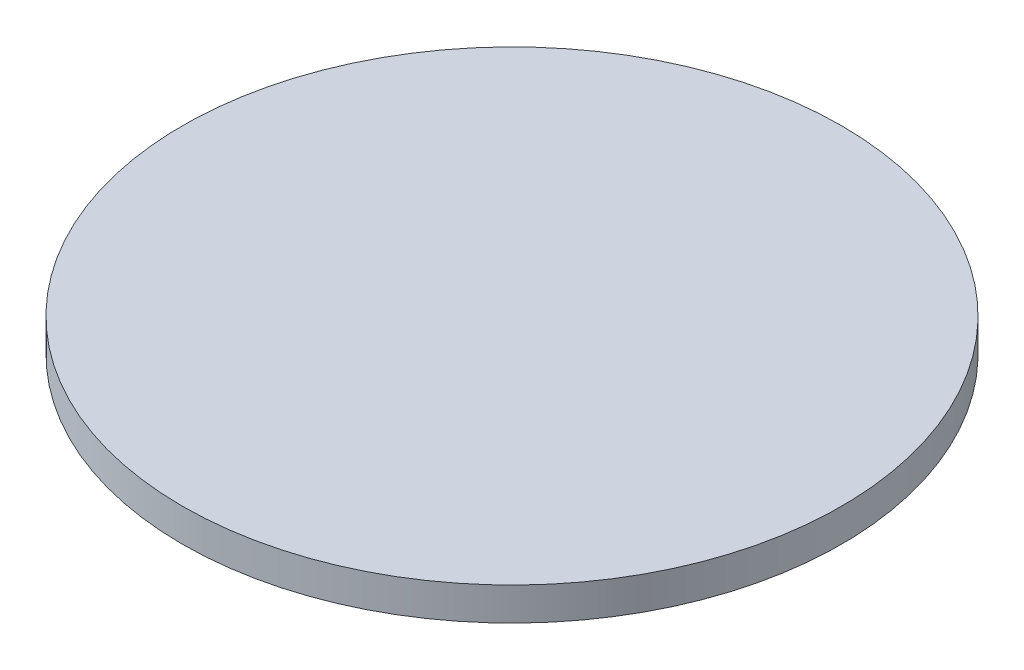
ISO-10303-21;
HEADER;
FILE_DESCRIPTION(('STEP AP214'),'2;1');
FILE_NAME('part.step','',(''),(''),'','','');
FILE_SCHEMA(('AUTOMOTIVE_DESIGN { 1 0 10303 214 1 1 1 1 }'));
ENDSEC;
DATA;
#1=APPLICATION_CONTEXT('core data for automotive mechanical design processes');
#2=APPLICATION_PROTOCOL_DEFINITION('international standard','automotive_design',2000,#1);
#3=PRODUCT_CONTEXT('',#1,'mechanical');
#4=PRODUCT('Part','Part','',(#3));
#5=PRODUCT_RELATED_PRODUCT_CATEGORY('part','',(#4));
#6=PRODUCT_DEFINITION_FORMATION('','',#4);
#7=PRODUCT_DEFINITION_CONTEXT('part definition',#1,'design');
#8=PRODUCT_DEFINITION('design','',#6,#7);
#9=PRODUCT_DEFINITION_SHAPE('','',#8);
#10=(LENGTH_UNIT() NAMED_UNIT(*) SI_UNIT(.MILLI.,.METRE.));
#11=(NAMED_UNIT(*) PLANE_ANGLE_UNIT() SI_UNIT($,.RADIAN.));
#12=(NAMED_UNIT(*) SI_UNIT($,.STERADIAN.) SOLID_ANGLE_UNIT());
#13=UNCERTAINTY_MEASURE_WITH_UNIT(LENGTH_MEASURE(1.E-05),#10,'distance_accuracy_value','');
#14=(GEOMETRIC_REPRESENTATION_CONTEXT(3) GLOBAL_UNCERTAINTY_ASSIGNED_CONTEXT((#13)) GLOBAL_UNIT_ASSIGNED_CONTEXT((#10,
#11,#12)) REPRESENTATION_CONTEXT('',''));
#15=CARTESIAN_POINT('',(0.,0.,0.));
#16=DIRECTION('',(0.,0.,1.));
#17=DIRECTION('',(1.,0.,0.));
#18=AXIS2_PLACEMENT_3D('',#15,#16,#17);
#19=CARTESIAN_POINT('',(0.,5.,0.));
#20=DIRECTION('',(0.,-1.,0.));
#21=DIRECTION('',(0.,0.,-1.));
#22=AXIS2_PLACEMENT_3D('',#19,#20,#21);
#23=CYLINDRICAL_SURFACE('',#22,50.);
#24=CARTESIAN_POINT('',(0.,5.,0.));
#25=DIRECTION('',(0.,1.,0.));
#26=DIRECTION('',(0.,0.,1.));
#27=AXIS2_PLACEMENT_3D('',#24,#25,#26);
#28=CIRCLE('',#27,50.);
#29=CARTESIAN_POINT('',(0.,5.,50.));
#30=VERTEX_POINT('',#29);
#31=EDGE_CURVE('E10',#30,#30,#28,.T.);
#32=ORIENTED_EDGE('',*,*,#31,.F.);
#33=EDGE_LOOP('',(#32));
#34=FACE_BOUND('',#33,.T.);
#35=CARTESIAN_POINT('',(0.,0.,0.));
#36=DIRECTION('',(0.,1.,0.));
#37=DIRECTION('',(0.,0.,1.));
#38=AXIS2_PLACEMENT_3D('',#35,#36,#37);
#39=CIRCLE('',#38,50.);
#40=CARTESIAN_POINT('',(0.,0.,50.));
#41=VERTEX_POINT('',#40);
#42=EDGE_CURVE('E34',#41,#41,#39,.T.);
#43=ORIENTED_EDGE('',*,*,#42,.T.);
#44=EDGE_LOOP('',(#43));
#45=FACE_BOUND('',#44,.T.);
#46=ADVANCED_FACE('F31',(#34,#45),#23,.T.);
#47=CARTESIAN_POINT('',(0.,5.,0.));
#48=DIRECTION('',(0.,1.,0.));
#49=DIRECTION('',(0.,0.,1.));
#50=AXIS2_PLACEMENT_3D('',#47,#48,#49);
#51=PLANE('',#50);
#52=ORIENTED_EDGE('',*,*,#31,.T.);
#53=EDGE_LOOP('',(#52));
#54=FACE_BOUND('',#53,.T.);
#55=ADVANCED_FACE('F46',(#54),#51,.T.);
#56=CARTESIAN_POINT('',(0.,0.,0.));
#57=DIRECTION('',(0.,1.,0.));
#58=DIRECTION('',(0.,0.,1.));
#59=AXIS2_PLACEMENT_3D('',#56,#57,#58);
#60=PLANE('',#59);
#61=ORIENTED_EDGE('',*,*,#42,.F.);
#62=EDGE_LOOP('',(#61));
#63=FACE_BOUND('',#62,.T.);
#64=ADVANCED_FACE('F44',(#63),#60,.F.);
#65=CLOSED_SHELL('',(#46,#55,#64));
#66=MANIFOLD_SOLID_BREP('B2',#65);
#67=ADVANCED_BREP_SHAPE_REPRESENTATION('',(#18,#66),#14);
#68=SHAPE_DEFINITION_REPRESENTATION(#9,#67);
ENDSEC;
END-ISO-10303-21;
